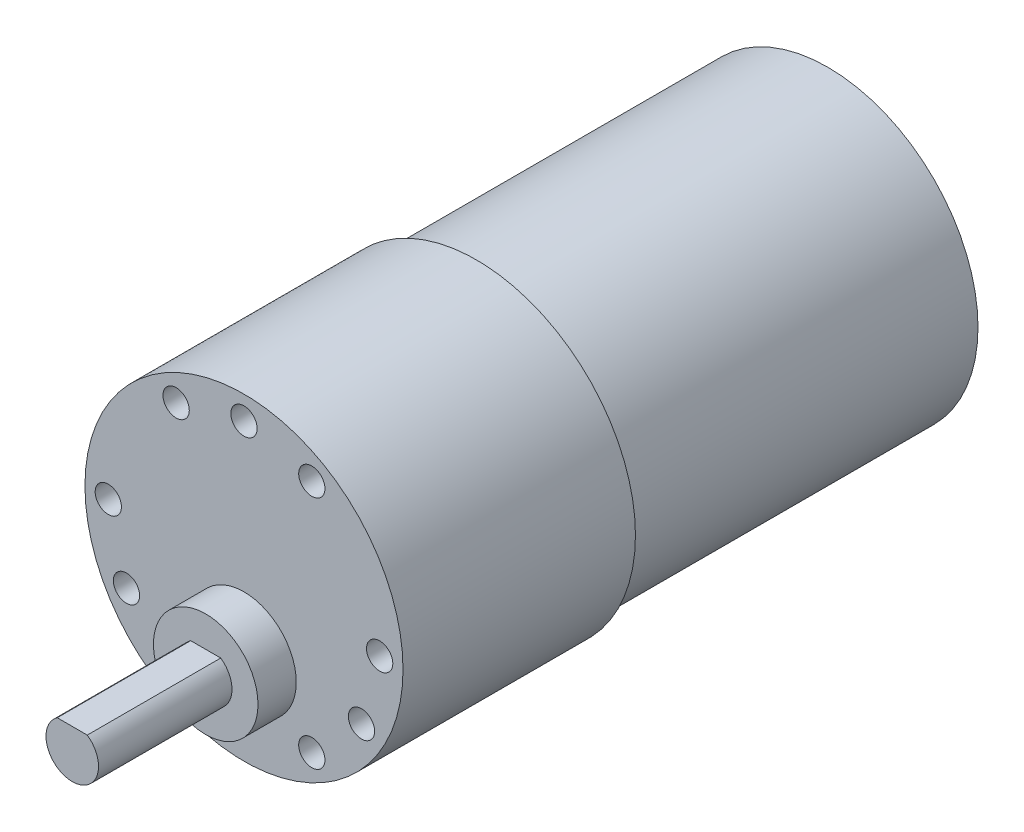
ISO-10303-21;
HEADER;
FILE_DESCRIPTION(('STEP AP214'),'2;1');
FILE_NAME('part.step','',(''),(''),'','','');
FILE_SCHEMA(('AUTOMOTIVE_DESIGN { 1 0 10303 214 1 1 1 1 }'));
ENDSEC;
DATA;
#1=APPLICATION_CONTEXT('core data for automotive mechanical design processes');
#2=APPLICATION_PROTOCOL_DEFINITION('international standard','automotive_design',2000,#1);
#3=PRODUCT_CONTEXT('',#1,'mechanical');
#4=PRODUCT('Part','Part','',(#3));
#5=PRODUCT_RELATED_PRODUCT_CATEGORY('part','',(#4));
#6=PRODUCT_DEFINITION_FORMATION('','',#4);
#7=PRODUCT_DEFINITION_CONTEXT('part definition',#1,'design');
#8=PRODUCT_DEFINITION('design','',#6,#7);
#9=PRODUCT_DEFINITION_SHAPE('','',#8);
#10=(LENGTH_UNIT() NAMED_UNIT(*) SI_UNIT(.MILLI.,.METRE.));
#11=(NAMED_UNIT(*) PLANE_ANGLE_UNIT() SI_UNIT($,.RADIAN.));
#12=(NAMED_UNIT(*) SI_UNIT($,.STERADIAN.) SOLID_ANGLE_UNIT());
#13=UNCERTAINTY_MEASURE_WITH_UNIT(LENGTH_MEASURE(1.E-05),#10,'distance_accuracy_value','');
#14=(GEOMETRIC_REPRESENTATION_CONTEXT(3) GLOBAL_UNCERTAINTY_ASSIGNED_CONTEXT((#13)) GLOBAL_UNIT_ASSIGNED_CONTEXT((#10,
#11,#12)) REPRESENTATION_CONTEXT('',''));
#15=CARTESIAN_POINT('',(0.,0.,0.));
#16=DIRECTION('',(0.,0.,1.));
#17=DIRECTION('',(1.,0.,0.));
#18=AXIS2_PLACEMENT_3D('',#15,#16,#17);
#19=CARTESIAN_POINT('',(0.,0.,-39.116));
#20=DIRECTION('',(0.,0.,-1.));
#21=DIRECTION('',(-1.,0.,0.));
#22=AXIS2_PLACEMENT_3D('',#19,#20,#21);
#23=PLANE('',#22);
#24=DIRECTION('',(0.642787609686543,-0.766044443118975,0.));
#25=VECTOR('',#24,1.);
#26=CARTESIAN_POINT('',(7.15248709016497,-8.91915603771026,-39.116));
#27=LINE('',#26,#25);
#28=CARTESIAN_POINT('',(5.51980656156115,-6.97340315218807,-39.116));
#29=VERTEX_POINT('',#28);
#30=CARTESIAN_POINT('',(7.15248709016497,-8.91915603771026,-39.116));
#31=VERTEX_POINT('',#30);
#32=EDGE_CURVE('E63',#29,#31,#27,.T.);
#33=ORIENTED_EDGE('',*,*,#32,.T.);
#34=DIRECTION('',(-0.766044443118975,-0.642787609686543,0.));
#35=VECTOR('',#34,1.);
#36=CARTESIAN_POINT('',(7.54163766726941,-8.5926199319895,-39.116));
#37=LINE('',#36,#35);
#38=CARTESIAN_POINT('',(7.54163766726941,-8.5926199319895,-39.116));
#39=VERTEX_POINT('',#38);
#40=EDGE_CURVE('E204',#39,#31,#37,.T.);
#41=ORIENTED_EDGE('',*,*,#40,.F.);
#42=DIRECTION('',(0.642787609686543,-0.766044443118975,0.));
#43=VECTOR('',#42,1.);
#44=CARTESIAN_POINT('',(7.54163766726941,-8.5926199319895,-39.116));
#45=LINE('',#44,#43);
#46=CARTESIAN_POINT('',(5.90895713866559,-6.6468670464673,-39.116));
#47=VERTEX_POINT('',#46);
#48=EDGE_CURVE('E179',#47,#39,#45,.T.);
#49=ORIENTED_EDGE('',*,*,#48,.F.);
#50=DIRECTION('',(-0.766044443118975,-0.642787609686543,0.));
#51=VECTOR('',#50,1.);
#52=CARTESIAN_POINT('',(5.90895713866559,-6.6468670464673,-39.116));
#53=LINE('',#52,#51);
#54=EDGE_CURVE('E189',#47,#29,#53,.T.);
#55=ORIENTED_EDGE('',*,*,#54,.T.);
#56=EDGE_LOOP('',(#33,#41,#49,#55));
#57=FACE_BOUND('',#56,.T.);
#58=CARTESIAN_POINT('',(0.,0.,-39.116));
#59=DIRECTION('',(0.,0.,-1.));
#60=DIRECTION('',(-1.,0.,0.));
#61=AXIS2_PLACEMENT_3D('',#58,#59,#60);
#62=CIRCLE('',#61,16.637);
#63=CARTESIAN_POINT('',(-16.637,0.,-39.116));
#64=VERTEX_POINT('',#63);
#65=EDGE_CURVE('E12',#64,#64,#62,.T.);
#66=ORIENTED_EDGE('',*,*,#65,.T.);
#67=EDGE_LOOP('',(#66));
#68=FACE_BOUND('',#67,.T.);
#69=DIRECTION('',(-0.258819045102518,-0.965925826289069,0.));
#70=VECTOR('',#69,1.);
#71=CARTESIAN_POINT('',(-2.87494665811901,-9.7480663576409,-39.116));
#72=LINE('',#71,#70);
#73=CARTESIAN_POINT('',(-2.87494665811901,-9.7480663576409,-39.116));
#74=VERTEX_POINT('',#73);
#75=CARTESIAN_POINT('',(-3.5323470326794,-12.2015179564151,-39.116));
#76=VERTEX_POINT('',#75);
#77=EDGE_CURVE('E55',#74,#76,#72,.T.);
#78=ORIENTED_EDGE('',*,*,#77,.T.);
#79=DIRECTION('',(-0.965925826289069,0.258819045102518,0.));
#80=VECTOR('',#79,1.);
#81=CARTESIAN_POINT('',(-3.04165671292456,-12.3329980313272,-39.116));
#82=LINE('',#81,#80);
#83=CARTESIAN_POINT('',(-3.04165671292456,-12.3329980313272,-39.116));
#84=VERTEX_POINT('',#83);
#85=EDGE_CURVE('E150',#84,#76,#82,.T.);
#86=ORIENTED_EDGE('',*,*,#85,.F.);
#87=DIRECTION('',(-0.258819045102518,-0.965925826289069,0.));
#88=VECTOR('',#87,1.);
#89=CARTESIAN_POINT('',(-2.38425633836416,-9.87954643255298,-39.116));
#90=LINE('',#89,#88);
#91=CARTESIAN_POINT('',(-2.38425633836416,-9.87954643255298,-39.116));
#92=VERTEX_POINT('',#91);
#93=EDGE_CURVE('E156',#92,#84,#90,.T.);
#94=ORIENTED_EDGE('',*,*,#93,.F.);
#95=DIRECTION('',(-0.965925826289069,0.258819045102518,0.));
#96=VECTOR('',#95,1.);
#97=CARTESIAN_POINT('',(-2.38425633836416,-9.87954643255298,-39.116));
#98=LINE('',#97,#96);
#99=EDGE_CURVE('E521',#92,#74,#98,.T.);
#100=ORIENTED_EDGE('',*,*,#99,.T.);
#101=EDGE_LOOP('',(#78,#86,#94,#100));
#102=FACE_BOUND('',#101,.T.);
#103=ADVANCED_FACE('F41',(#57,#68,#102),#23,.T.);
#104=CARTESIAN_POINT('',(0.,0.,-40.132));
#105=DIRECTION('',(0.,0.,-1.));
#106=DIRECTION('',(-1.,0.,0.));
#107=AXIS2_PLACEMENT_3D('',#104,#105,#106);
#108=PLANE('',#107);
#109=CARTESIAN_POINT('',(0.,0.,-40.132));
#110=DIRECTION('',(0.,0.,-1.));
#111=DIRECTION('',(-1.,0.,0.));
#112=AXIS2_PLACEMENT_3D('',#109,#110,#111);
#113=CIRCLE('',#112,16.637);
#114=CARTESIAN_POINT('',(-16.637,0.,-40.132));
#115=VERTEX_POINT('',#114);
#116=EDGE_CURVE('E48',#115,#115,#113,.T.);
#117=ORIENTED_EDGE('',*,*,#116,.F.);
#118=EDGE_LOOP('',(#117));
#119=FACE_BOUND('',#118,.T.);
#120=CARTESIAN_POINT('',(0.,0.,-40.132));
#121=DIRECTION('',(0.,0.,-1.));
#122=DIRECTION('',(-1.,0.,0.));
#123=AXIS2_PLACEMENT_3D('',#120,#121,#122);
#124=CIRCLE('',#123,17.145);
#125=CARTESIAN_POINT('',(-17.145,0.,-40.132));
#126=VERTEX_POINT('',#125);
#127=EDGE_CURVE('E207',#126,#126,#124,.T.);
#128=ORIENTED_EDGE('',*,*,#127,.T.);
#129=EDGE_LOOP('',(#128));
#130=FACE_BOUND('',#129,.T.);
#131=ADVANCED_FACE('F298',(#119,#130),#108,.T.);
#132=CARTESIAN_POINT('',(0.,0.,0.));
#133=DIRECTION('',(0.,0.,1.));
#134=DIRECTION('',(1.,0.,0.));
#135=AXIS2_PLACEMENT_3D('',#132,#133,#134);
#136=PLANE('',#135);
#137=CARTESIAN_POINT('',(0.,0.,0.));
#138=DIRECTION('',(0.,0.,1.));
#139=DIRECTION('',(1.,0.,0.));
#140=AXIS2_PLACEMENT_3D('',#137,#138,#139);
#141=CIRCLE('',#140,18.161);
#142=CARTESIAN_POINT('',(18.161,0.,0.));
#143=VERTEX_POINT('',#142);
#144=EDGE_CURVE('E212',#143,#143,#141,.T.);
#145=ORIENTED_EDGE('',*,*,#144,.F.);
#146=EDGE_LOOP('',(#145));
#147=FACE_BOUND('',#146,.T.);
#148=CARTESIAN_POINT('',(0.,0.,0.));
#149=DIRECTION('',(0.,0.,1.));
#150=DIRECTION('',(1.,0.,0.));
#151=AXIS2_PLACEMENT_3D('',#148,#149,#150);
#152=CIRCLE('',#151,17.145);
#153=CARTESIAN_POINT('',(17.145,0.,0.));
#154=VERTEX_POINT('',#153);
#155=EDGE_CURVE('E208',#154,#154,#152,.F.);
#156=ORIENTED_EDGE('',*,*,#155,.F.);
#157=EDGE_LOOP('',(#156));
#158=FACE_BOUND('',#157,.T.);
#159=ADVANCED_FACE('F301',(#147,#158),#136,.F.);
#160=CARTESIAN_POINT('',(0.,-7.366,30.9118));
#161=DIRECTION('',(0.,0.,1.));
#162=DIRECTION('',(1.,0.,0.));
#163=AXIS2_PLACEMENT_3D('',#160,#161,#162);
#164=PLANE('',#163);
#165=CARTESIAN_POINT('',(0.,-7.366,30.9118));
#166=DIRECTION('',(0.,0.,1.));
#167=DIRECTION('',(1.,0.,0.));
#168=AXIS2_PLACEMENT_3D('',#165,#166,#167);
#169=CIRCLE('',#168,5.969);
#170=CARTESIAN_POINT('',(5.969,-7.366,30.9118));
#171=VERTEX_POINT('',#170);
#172=EDGE_CURVE('E219',#171,#171,#169,.T.);
#173=ORIENTED_EDGE('',*,*,#172,.T.);
#174=EDGE_LOOP('',(#173));
#175=FACE_BOUND('',#174,.T.);
#176=DIRECTION('',(-1.,0.,0.));
#177=VECTOR('',#176,1.);
#178=CARTESIAN_POINT('',(-1.71565701700544,-4.905,30.9118));
#179=LINE('',#178,#177);
#180=CARTESIAN_POINT('',(1.71565701700544,-4.905,30.9118));
#181=VERTEX_POINT('',#180);
#182=CARTESIAN_POINT('',(-1.71565701700544,-4.905,30.9118));
#183=VERTEX_POINT('',#182);
#184=EDGE_CURVE('E229',#181,#183,#179,.T.);
#185=ORIENTED_EDGE('',*,*,#184,.F.);
#186=CARTESIAN_POINT('',(0.,-7.366,30.9118));
#187=DIRECTION('',(0.,0.,1.));
#188=DIRECTION('',(1.,0.,0.));
#189=AXIS2_PLACEMENT_3D('',#186,#187,#188);
#190=CIRCLE('',#189,3.);
#191=EDGE_CURVE('E222',#183,#181,#190,.T.);
#192=ORIENTED_EDGE('',*,*,#191,.F.);
#193=EDGE_LOOP('',(#185,#192));
#194=FACE_BOUND('',#193,.T.);
#195=ADVANCED_FACE('F313',(#175,#194),#164,.T.);
#196=CARTESIAN_POINT('',(0.,0.,26.543));
#197=DIRECTION('',(0.,0.,1.));
#198=DIRECTION('',(1.,0.,0.));
#199=AXIS2_PLACEMENT_3D('',#196,#197,#198);
#200=PLANE('',#199);
#201=CARTESIAN_POINT('',(-7.74699999999983,13.4181976062362,26.543));
#202=DIRECTION('',(0.,0.,1.));
#203=DIRECTION('',(1.,0.,0.));
#204=AXIS2_PLACEMENT_3D('',#201,#202,#203);
#205=CIRCLE('',#204,1.49999999999999);
#206=CARTESIAN_POINT('',(-6.24699999999984,13.4181976062362,26.543));
#207=VERTEX_POINT('',#206);
#208=EDGE_CURVE('E211',#207,#207,#205,.T.);
#209=ORIENTED_EDGE('',*,*,#208,.F.);
#210=EDGE_LOOP('',(#209));
#211=FACE_BOUND('',#210,.T.);
#212=CARTESIAN_POINT('',(-15.494,1.62291035592107E-13,26.543));
#213=DIRECTION('',(0.,0.,1.));
#214=DIRECTION('',(1.,0.,0.));
#215=AXIS2_PLACEMENT_3D('',#212,#213,#214);
#216=CIRCLE('',#215,1.49999999999999);
#217=CARTESIAN_POINT('',(-13.994,1.62291035592107E-13,26.543));
#218=VERTEX_POINT('',#217);
#219=EDGE_CURVE('E284',#218,#218,#216,.T.);
#220=ORIENTED_EDGE('',*,*,#219,.F.);
#221=EDGE_LOOP('',(#220));
#222=FACE_BOUND('',#221,.T.);
#223=CARTESIAN_POINT('',(-13.4181976062362,-7.74699999999987,26.543));
#224=DIRECTION('',(0.,0.,1.));
#225=DIRECTION('',(1.,0.,0.));
#226=AXIS2_PLACEMENT_3D('',#223,#224,#225);
#227=CIRCLE('',#226,1.49999999999999);
#228=CARTESIAN_POINT('',(-11.9181976062362,-7.74699999999987,26.543));
#229=VERTEX_POINT('',#228);
#230=EDGE_CURVE('E278',#229,#229,#227,.T.);
#231=ORIENTED_EDGE('',*,*,#230,.F.);
#232=EDGE_LOOP('',(#231));
#233=FACE_BOUND('',#232,.T.);
#234=CARTESIAN_POINT('',(-7.74700000000011,-13.418197606236,26.543));
#235=DIRECTION('',(0.,0.,1.));
#236=DIRECTION('',(1.,0.,0.));
#237=AXIS2_PLACEMENT_3D('',#234,#235,#236);
#238=CIRCLE('',#237,1.49999999999999);
#239=CARTESIAN_POINT('',(-6.24700000000012,-13.418197606236,26.543));
#240=VERTEX_POINT('',#239);
#241=EDGE_CURVE('E272',#240,#240,#238,.T.);
#242=ORIENTED_EDGE('',*,*,#241,.F.);
#243=EDGE_LOOP('',(#242));
#244=FACE_BOUND('',#243,.T.);
#245=CARTESIAN_POINT('',(7.74699999999992,-13.4181976062361,26.543));
#246=DIRECTION('',(0.,0.,1.));
#247=DIRECTION('',(1.,0.,0.));
#248=AXIS2_PLACEMENT_3D('',#245,#246,#247);
#249=CIRCLE('',#248,1.49999999999999);
#250=CARTESIAN_POINT('',(9.24699999999991,-13.4181976062361,26.543));
#251=VERTEX_POINT('',#250);
#252=EDGE_CURVE('E266',#251,#251,#249,.T.);
#253=ORIENTED_EDGE('',*,*,#252,.F.);
#254=EDGE_LOOP('',(#253));
#255=FACE_BOUND('',#254,.T.);
#256=CARTESIAN_POINT('',(13.4181976062361,-7.74700000000006,26.543));
#257=DIRECTION('',(0.,0.,1.));
#258=DIRECTION('',(1.,0.,0.));
#259=AXIS2_PLACEMENT_3D('',#256,#257,#258);
#260=CIRCLE('',#259,1.49999999999999);
#261=CARTESIAN_POINT('',(14.918197606236,-7.74700000000006,26.543));
#262=VERTEX_POINT('',#261);
#263=EDGE_CURVE('E260',#262,#262,#260,.T.);
#264=ORIENTED_EDGE('',*,*,#263,.F.);
#265=EDGE_LOOP('',(#264));
#266=FACE_BOUND('',#265,.T.);
#267=CARTESIAN_POINT('',(15.494,0.,26.543));
#268=DIRECTION('',(0.,0.,1.));
#269=DIRECTION('',(1.,0.,0.));
#270=AXIS2_PLACEMENT_3D('',#267,#268,#269);
#271=CIRCLE('',#270,1.49999999999999);
#272=CARTESIAN_POINT('',(16.994,0.,26.543));
#273=VERTEX_POINT('',#272);
#274=EDGE_CURVE('E254',#273,#273,#271,.T.);
#275=ORIENTED_EDGE('',*,*,#274,.F.);
#276=EDGE_LOOP('',(#275));
#277=FACE_BOUND('',#276,.T.);
#278=CARTESIAN_POINT('',(7.74700000000001,13.4181976062361,26.543));
#279=DIRECTION('',(0.,0.,1.));
#280=DIRECTION('',(1.,0.,0.));
#281=AXIS2_PLACEMENT_3D('',#278,#279,#280);
#282=CIRCLE('',#281,1.49999999999999);
#283=CARTESIAN_POINT('',(9.24700000000001,13.4181976062361,26.543));
#284=VERTEX_POINT('',#283);
#285=EDGE_CURVE('E248',#284,#284,#282,.T.);
#286=ORIENTED_EDGE('',*,*,#285,.F.);
#287=EDGE_LOOP('',(#286));
#288=FACE_BOUND('',#287,.T.);
#289=CARTESIAN_POINT('',(0.,15.494,26.543));
#290=DIRECTION('',(0.,0.,1.));
#291=DIRECTION('',(1.,0.,0.));
#292=AXIS2_PLACEMENT_3D('',#289,#290,#291);
#293=CIRCLE('',#292,1.49999999999999);
#294=CARTESIAN_POINT('',(1.49999999999999,15.494,26.543));
#295=VERTEX_POINT('',#294);
#296=EDGE_CURVE('E242',#295,#295,#293,.T.);
#297=ORIENTED_EDGE('',*,*,#296,.F.);
#298=EDGE_LOOP('',(#297));
#299=FACE_BOUND('',#298,.T.);
#300=CARTESIAN_POINT('',(0.,0.,26.543));
#301=DIRECTION('',(0.,0.,1.));
#302=DIRECTION('',(1.,0.,0.));
#303=AXIS2_PLACEMENT_3D('',#300,#301,#302);
#304=CIRCLE('',#303,18.161);
#305=CARTESIAN_POINT('',(18.161,0.,26.543));
#306=VERTEX_POINT('',#305);
#307=EDGE_CURVE('E216',#306,#306,#304,.T.);
#308=ORIENTED_EDGE('',*,*,#307,.T.);
#309=EDGE_LOOP('',(#308));
#310=FACE_BOUND('',#309,.T.);
#311=CARTESIAN_POINT('',(0.,-7.366,26.543));
#312=DIRECTION('',(0.,0.,1.));
#313=DIRECTION('',(1.,0.,0.));
#314=AXIS2_PLACEMENT_3D('',#311,#312,#313);
#315=CIRCLE('',#314,5.969);
#316=CARTESIAN_POINT('',(5.969,-7.366,26.543));
#317=VERTEX_POINT('',#316);
#318=EDGE_CURVE('E215',#317,#317,#315,.T.);
#319=ORIENTED_EDGE('',*,*,#318,.F.);
#320=EDGE_LOOP('',(#319));
#321=FACE_BOUND('',#320,.T.);
#322=ADVANCED_FACE('F319',(#211,#222,#233,#244,#255,#266,#277,#288,#299,#310,#321),#200,.T.);
#323=CARTESIAN_POINT('',(0.,0.,26.543));
#324=DIRECTION('',(0.,0.,-1.));
#325=DIRECTION('',(-1.,0.,0.));
#326=AXIS2_PLACEMENT_3D('',#323,#324,#325);
#327=CYLINDRICAL_SURFACE('',#326,18.161);
#328=ORIENTED_EDGE('',*,*,#307,.F.);
#329=EDGE_LOOP('',(#328));
#330=FACE_BOUND('',#329,.T.);
#331=ORIENTED_EDGE('',*,*,#144,.T.);
#332=EDGE_LOOP('',(#331));
#333=FACE_BOUND('',#332,.T.);
#334=ADVANCED_FACE('F427',(#330,#333),#327,.T.);
#335=CARTESIAN_POINT('',(0.,-7.366,30.9118));
#336=DIRECTION('',(0.,0.,-1.));
#337=DIRECTION('',(-1.,0.,0.));
#338=AXIS2_PLACEMENT_3D('',#335,#336,#337);
#339=CYLINDRICAL_SURFACE('',#338,5.969);
#340=ORIENTED_EDGE('',*,*,#172,.F.);
#341=EDGE_LOOP('',(#340));
#342=FACE_BOUND('',#341,.T.);
#343=ORIENTED_EDGE('',*,*,#318,.T.);
#344=EDGE_LOOP('',(#343));
#345=FACE_BOUND('',#344,.T.);
#346=ADVANCED_FACE('F423',(#342,#345),#339,.T.);
#347=CARTESIAN_POINT('',(0.,-7.366,46.1518));
#348=DIRECTION('',(0.,0.,-1.));
#349=DIRECTION('',(-1.,0.,0.));
#350=AXIS2_PLACEMENT_3D('',#347,#348,#349);
#351=CYLINDRICAL_SURFACE('',#350,3.);
#352=ORIENTED_EDGE('',*,*,#191,.T.);
#353=DIRECTION('',(0.,0.,-1.));
#354=VECTOR('',#353,1.);
#355=CARTESIAN_POINT('',(1.71565701700544,-4.905,46.1518));
#356=LINE('',#355,#354);
#357=CARTESIAN_POINT('',(1.71565701700544,-4.905,46.1518));
#358=VERTEX_POINT('',#357);
#359=EDGE_CURVE('E225',#358,#181,#356,.T.);
#360=ORIENTED_EDGE('',*,*,#359,.F.);
#361=CARTESIAN_POINT('',(0.,-7.366,46.1518));
#362=DIRECTION('',(0.,0.,1.));
#363=DIRECTION('',(1.,0.,0.));
#364=AXIS2_PLACEMENT_3D('',#361,#362,#363);
#365=CIRCLE('',#364,3.);
#366=CARTESIAN_POINT('',(-1.71565701700544,-4.905,46.1518));
#367=VERTEX_POINT('',#366);
#368=EDGE_CURVE('E228',#367,#358,#365,.T.);
#369=ORIENTED_EDGE('',*,*,#368,.F.);
#370=DIRECTION('',(0.,0.,-1.));
#371=VECTOR('',#370,1.);
#372=CARTESIAN_POINT('',(-1.71565701700544,-4.905,46.1518));
#373=LINE('',#372,#371);
#374=EDGE_CURVE('E230',#367,#183,#373,.T.);
#375=ORIENTED_EDGE('',*,*,#374,.T.);
#376=EDGE_LOOP('',(#352,#360,#369,#375));
#377=FACE_BOUND('',#376,.T.);
#378=ADVANCED_FACE('F420',(#377),#351,.T.);
#379=CARTESIAN_POINT('',(-1.71565701700544,-4.905,46.1518));
#380=DIRECTION('',(0.,-1.,0.));
#381=DIRECTION('',(0.,0.,-1.));
#382=AXIS2_PLACEMENT_3D('',#379,#380,#381);
#383=PLANE('',#382);
#384=ORIENTED_EDGE('',*,*,#184,.T.);
#385=ORIENTED_EDGE('',*,*,#374,.F.);
#386=DIRECTION('',(-1.,0.,0.));
#387=VECTOR('',#386,1.);
#388=CARTESIAN_POINT('',(-1.71565701700544,-4.905,46.1518));
#389=LINE('',#388,#387);
#390=EDGE_CURVE('E235',#358,#367,#389,.T.);
#391=ORIENTED_EDGE('',*,*,#390,.F.);
#392=ORIENTED_EDGE('',*,*,#359,.T.);
#393=EDGE_LOOP('',(#384,#385,#391,#392));
#394=FACE_BOUND('',#393,.T.);
#395=ADVANCED_FACE('F416',(#394),#383,.F.);
#396=CARTESIAN_POINT('',(0.,-7.366,46.1518));
#397=DIRECTION('',(0.,0.,1.));
#398=DIRECTION('',(1.,0.,0.));
#399=AXIS2_PLACEMENT_3D('',#396,#397,#398);
#400=PLANE('',#399);
#401=ORIENTED_EDGE('',*,*,#368,.T.);
#402=ORIENTED_EDGE('',*,*,#390,.T.);
#403=EDGE_LOOP('',(#401,#402));
#404=FACE_BOUND('',#403,.T.);
#405=ADVANCED_FACE('F412',(#404),#400,.T.);
#406=CARTESIAN_POINT('',(0.,15.494,16.383));
#407=DIRECTION('',(0.,0.,1.));
#408=DIRECTION('',(1.,0.,0.));
#409=AXIS2_PLACEMENT_3D('',#406,#407,#408);
#410=CONICAL_SURFACE('',#409,1.49999999999999,1.02974425867665);
#411=CARTESIAN_POINT('',(0.,15.494,15.4817090714587));
#412=VERTEX_POINT('',#411);
#413=VERTEX_LOOP('',#412);
#414=FACE_BOUND('',#413,.T.);
#415=CARTESIAN_POINT('',(0.,15.494,16.383));
#416=DIRECTION('',(0.,0.,1.));
#417=DIRECTION('',(1.,0.,0.));
#418=AXIS2_PLACEMENT_3D('',#415,#416,#417);
#419=CIRCLE('',#418,1.49999999999999);
#420=CARTESIAN_POINT('',(1.49999999999999,15.494,16.383));
#421=VERTEX_POINT('',#420);
#422=EDGE_CURVE('E237',#421,#421,#419,.T.);
#423=ORIENTED_EDGE('',*,*,#422,.T.);
#424=EDGE_LOOP('',(#423));
#425=FACE_BOUND('',#424,.T.);
#426=ADVANCED_FACE('F408',(#414,#425),#410,.F.);
#427=CARTESIAN_POINT('',(0.,15.494,26.543));
#428=DIRECTION('',(0.,0.,1.));
#429=DIRECTION('',(1.,0.,0.));
#430=AXIS2_PLACEMENT_3D('',#427,#428,#429);
#431=CYLINDRICAL_SURFACE('',#430,1.49999999999999);
#432=ORIENTED_EDGE('',*,*,#422,.F.);
#433=EDGE_LOOP('',(#432));
#434=FACE_BOUND('',#433,.T.);
#435=ORIENTED_EDGE('',*,*,#296,.T.);
#436=EDGE_LOOP('',(#435));
#437=FACE_BOUND('',#436,.T.);
#438=ADVANCED_FACE('F404',(#434,#437),#431,.F.);
#439=CARTESIAN_POINT('',(7.74700000000001,13.4181976062361,16.383));
#440=DIRECTION('',(0.,0.,1.));
#441=DIRECTION('',(1.,0.,0.));
#442=AXIS2_PLACEMENT_3D('',#439,#440,#441);
#443=CONICAL_SURFACE('',#442,1.49999999999999,1.02974425867665);
#444=CARTESIAN_POINT('',(7.74700000000001,13.4181976062361,15.4817090714587));
#445=VERTEX_POINT('',#444);
#446=VERTEX_LOOP('',#445);
#447=FACE_BOUND('',#446,.T.);
#448=CARTESIAN_POINT('',(7.74700000000001,13.4181976062361,16.383));
#449=DIRECTION('',(0.,0.,1.));
#450=DIRECTION('',(1.,0.,0.));
#451=AXIS2_PLACEMENT_3D('',#448,#449,#450);
#452=CIRCLE('',#451,1.49999999999999);
#453=CARTESIAN_POINT('',(9.247,13.4181976062361,16.383));
#454=VERTEX_POINT('',#453);
#455=EDGE_CURVE('E245',#454,#454,#452,.T.);
#456=ORIENTED_EDGE('',*,*,#455,.T.);
#457=EDGE_LOOP('',(#456));
#458=FACE_BOUND('',#457,.T.);
#459=ADVANCED_FACE('F400',(#447,#458),#443,.F.);
#460=CARTESIAN_POINT('',(7.74700000000001,13.4181976062361,26.543));
#461=DIRECTION('',(0.,0.,1.));
#462=DIRECTION('',(1.,0.,0.));
#463=AXIS2_PLACEMENT_3D('',#460,#461,#462);
#464=CYLINDRICAL_SURFACE('',#463,1.49999999999999);
#465=ORIENTED_EDGE('',*,*,#455,.F.);
#466=EDGE_LOOP('',(#465));
#467=FACE_BOUND('',#466,.T.);
#468=ORIENTED_EDGE('',*,*,#285,.T.);
#469=EDGE_LOOP('',(#468));
#470=FACE_BOUND('',#469,.T.);
#471=ADVANCED_FACE('F396',(#467,#470),#464,.F.);
#472=CARTESIAN_POINT('',(15.494,0.,16.383));
#473=DIRECTION('',(0.,0.,1.));
#474=DIRECTION('',(1.,0.,0.));
#475=AXIS2_PLACEMENT_3D('',#472,#473,#474);
#476=CONICAL_SURFACE('',#475,1.49999999999999,1.02974425867665);
#477=CARTESIAN_POINT('',(15.494,0.,15.4817090714587));
#478=VERTEX_POINT('',#477);
#479=VERTEX_LOOP('',#478);
#480=FACE_BOUND('',#479,.T.);
#481=CARTESIAN_POINT('',(15.494,0.,16.383));
#482=DIRECTION('',(0.,0.,1.));
#483=DIRECTION('',(1.,0.,0.));
#484=AXIS2_PLACEMENT_3D('',#481,#482,#483);
#485=CIRCLE('',#484,1.49999999999999);
#486=CARTESIAN_POINT('',(16.994,0.,16.383));
#487=VERTEX_POINT('',#486);
#488=EDGE_CURVE('E251',#487,#487,#485,.T.);
#489=ORIENTED_EDGE('',*,*,#488,.T.);
#490=EDGE_LOOP('',(#489));
#491=FACE_BOUND('',#490,.T.);
#492=ADVANCED_FACE('F392',(#480,#491),#476,.F.);
#493=CARTESIAN_POINT('',(15.494,0.,26.543));
#494=DIRECTION('',(0.,0.,1.));
#495=DIRECTION('',(1.,0.,0.));
#496=AXIS2_PLACEMENT_3D('',#493,#494,#495);
#497=CYLINDRICAL_SURFACE('',#496,1.49999999999999);
#498=ORIENTED_EDGE('',*,*,#488,.F.);
#499=EDGE_LOOP('',(#498));
#500=FACE_BOUND('',#499,.T.);
#501=ORIENTED_EDGE('',*,*,#274,.T.);
#502=EDGE_LOOP('',(#501));
#503=FACE_BOUND('',#502,.T.);
#504=ADVANCED_FACE('F388',(#500,#503),#497,.F.);
#505=CARTESIAN_POINT('',(13.4181976062361,-7.74700000000006,16.383));
#506=DIRECTION('',(0.,0.,1.));
#507=DIRECTION('',(1.,0.,0.));
#508=AXIS2_PLACEMENT_3D('',#505,#506,#507);
#509=CONICAL_SURFACE('',#508,1.49999999999999,1.02974425867665);
#510=CARTESIAN_POINT('',(13.4181976062361,-7.74700000000006,15.4817090714587));
#511=VERTEX_POINT('',#510);
#512=VERTEX_LOOP('',#511);
#513=FACE_BOUND('',#512,.T.);
#514=CARTESIAN_POINT('',(13.4181976062361,-7.74700000000006,16.383));
#515=DIRECTION('',(0.,0.,1.));
#516=DIRECTION('',(1.,0.,0.));
#517=AXIS2_PLACEMENT_3D('',#514,#515,#516);
#518=CIRCLE('',#517,1.49999999999999);
#519=CARTESIAN_POINT('',(14.918197606236,-7.74700000000006,16.383));
#520=VERTEX_POINT('',#519);
#521=EDGE_CURVE('E257',#520,#520,#518,.T.);
#522=ORIENTED_EDGE('',*,*,#521,.T.);
#523=EDGE_LOOP('',(#522));
#524=FACE_BOUND('',#523,.T.);
#525=ADVANCED_FACE('F384',(#513,#524),#509,.F.);
#526=CARTESIAN_POINT('',(13.4181976062361,-7.74700000000006,26.543));
#527=DIRECTION('',(0.,0.,1.));
#528=DIRECTION('',(1.,0.,0.));
#529=AXIS2_PLACEMENT_3D('',#526,#527,#528);
#530=CYLINDRICAL_SURFACE('',#529,1.49999999999999);
#531=ORIENTED_EDGE('',*,*,#521,.F.);
#532=EDGE_LOOP('',(#531));
#533=FACE_BOUND('',#532,.T.);
#534=ORIENTED_EDGE('',*,*,#263,.T.);
#535=EDGE_LOOP('',(#534));
#536=FACE_BOUND('',#535,.T.);
#537=ADVANCED_FACE('F380',(#533,#536),#530,.F.);
#538=CARTESIAN_POINT('',(7.74699999999992,-13.4181976062361,16.383));
#539=DIRECTION('',(0.,0.,1.));
#540=DIRECTION('',(1.,0.,0.));
#541=AXIS2_PLACEMENT_3D('',#538,#539,#540);
#542=CONICAL_SURFACE('',#541,1.49999999999999,1.02974425867665);
#543=CARTESIAN_POINT('',(7.74699999999992,-13.4181976062361,15.4817090714587));
#544=VERTEX_POINT('',#543);
#545=VERTEX_LOOP('',#544);
#546=FACE_BOUND('',#545,.T.);
#547=CARTESIAN_POINT('',(7.74699999999992,-13.4181976062361,16.383));
#548=DIRECTION('',(0.,0.,1.));
#549=DIRECTION('',(1.,0.,0.));
#550=AXIS2_PLACEMENT_3D('',#547,#548,#549);
#551=CIRCLE('',#550,1.49999999999999);
#552=CARTESIAN_POINT('',(9.24699999999991,-13.4181976062361,16.383));
#553=VERTEX_POINT('',#552);
#554=EDGE_CURVE('E263',#553,#553,#551,.T.);
#555=ORIENTED_EDGE('',*,*,#554,.T.);
#556=EDGE_LOOP('',(#555));
#557=FACE_BOUND('',#556,.T.);
#558=ADVANCED_FACE('F376',(#546,#557),#542,.F.);
#559=CARTESIAN_POINT('',(7.74699999999992,-13.4181976062361,26.543));
#560=DIRECTION('',(0.,0.,1.));
#561=DIRECTION('',(1.,0.,0.));
#562=AXIS2_PLACEMENT_3D('',#559,#560,#561);
#563=CYLINDRICAL_SURFACE('',#562,1.49999999999999);
#564=ORIENTED_EDGE('',*,*,#554,.F.);
#565=EDGE_LOOP('',(#564));
#566=FACE_BOUND('',#565,.T.);
#567=ORIENTED_EDGE('',*,*,#252,.T.);
#568=EDGE_LOOP('',(#567));
#569=FACE_BOUND('',#568,.T.);
#570=ADVANCED_FACE('F372',(#566,#569),#563,.F.);
#571=CARTESIAN_POINT('',(-7.74700000000011,-13.418197606236,16.383));
#572=DIRECTION('',(0.,0.,1.));
#573=DIRECTION('',(1.,0.,0.));
#574=AXIS2_PLACEMENT_3D('',#571,#572,#573);
#575=CONICAL_SURFACE('',#574,1.49999999999999,1.02974425867665);
#576=CARTESIAN_POINT('',(-7.74700000000011,-13.418197606236,15.4817090714587));
#577=VERTEX_POINT('',#576);
#578=VERTEX_LOOP('',#577);
#579=FACE_BOUND('',#578,.T.);
#580=CARTESIAN_POINT('',(-7.74700000000011,-13.418197606236,16.383));
#581=DIRECTION('',(0.,0.,1.));
#582=DIRECTION('',(1.,0.,0.));
#583=AXIS2_PLACEMENT_3D('',#580,#581,#582);
#584=CIRCLE('',#583,1.49999999999999);
#585=CARTESIAN_POINT('',(-6.24700000000012,-13.418197606236,16.383));
#586=VERTEX_POINT('',#585);
#587=EDGE_CURVE('E269',#586,#586,#584,.T.);
#588=ORIENTED_EDGE('',*,*,#587,.T.);
#589=EDGE_LOOP('',(#588));
#590=FACE_BOUND('',#589,.T.);
#591=ADVANCED_FACE('F368',(#579,#590),#575,.F.);
#592=CARTESIAN_POINT('',(-7.74700000000011,-13.418197606236,26.543));
#593=DIRECTION('',(0.,0.,1.));
#594=DIRECTION('',(1.,0.,0.));
#595=AXIS2_PLACEMENT_3D('',#592,#593,#594);
#596=CYLINDRICAL_SURFACE('',#595,1.49999999999999);
#597=ORIENTED_EDGE('',*,*,#587,.F.);
#598=EDGE_LOOP('',(#597));
#599=FACE_BOUND('',#598,.T.);
#600=ORIENTED_EDGE('',*,*,#241,.T.);
#601=EDGE_LOOP('',(#600));
#602=FACE_BOUND('',#601,.T.);
#603=ADVANCED_FACE('F364',(#599,#602),#596,.F.);
#604=CARTESIAN_POINT('',(-13.4181976062362,-7.74699999999987,16.383));
#605=DIRECTION('',(0.,0.,1.));
#606=DIRECTION('',(1.,0.,0.));
#607=AXIS2_PLACEMENT_3D('',#604,#605,#606);
#608=CONICAL_SURFACE('',#607,1.49999999999999,1.02974425867665);
#609=CARTESIAN_POINT('',(-13.4181976062362,-7.74699999999987,15.4817090714587));
#610=VERTEX_POINT('',#609);
#611=VERTEX_LOOP('',#610);
#612=FACE_BOUND('',#611,.T.);
#613=CARTESIAN_POINT('',(-13.4181976062362,-7.74699999999987,16.383));
#614=DIRECTION('',(0.,0.,1.));
#615=DIRECTION('',(1.,0.,0.));
#616=AXIS2_PLACEMENT_3D('',#613,#614,#615);
#617=CIRCLE('',#616,1.49999999999999);
#618=CARTESIAN_POINT('',(-11.9181976062362,-7.74699999999987,16.383));
#619=VERTEX_POINT('',#618);
#620=EDGE_CURVE('E275',#619,#619,#617,.T.);
#621=ORIENTED_EDGE('',*,*,#620,.T.);
#622=EDGE_LOOP('',(#621));
#623=FACE_BOUND('',#622,.T.);
#624=ADVANCED_FACE('F360',(#612,#623),#608,.F.);
#625=CARTESIAN_POINT('',(-13.4181976062362,-7.74699999999987,26.543));
#626=DIRECTION('',(0.,0.,1.));
#627=DIRECTION('',(1.,0.,0.));
#628=AXIS2_PLACEMENT_3D('',#625,#626,#627);
#629=CYLINDRICAL_SURFACE('',#628,1.49999999999999);
#630=ORIENTED_EDGE('',*,*,#620,.F.);
#631=EDGE_LOOP('',(#630));
#632=FACE_BOUND('',#631,.T.);
#633=ORIENTED_EDGE('',*,*,#230,.T.);
#634=EDGE_LOOP('',(#633));
#635=FACE_BOUND('',#634,.T.);
#636=ADVANCED_FACE('F356',(#632,#635),#629,.F.);
#637=CARTESIAN_POINT('',(-15.494,1.62291035592107E-13,16.383));
#638=DIRECTION('',(0.,0.,1.));
#639=DIRECTION('',(1.,0.,0.));
#640=AXIS2_PLACEMENT_3D('',#637,#638,#639);
#641=CONICAL_SURFACE('',#640,1.49999999999999,1.02974425867665);
#642=CARTESIAN_POINT('',(-15.494,1.62291035592107E-13,15.4817090714587));
#643=VERTEX_POINT('',#642);
#644=VERTEX_LOOP('',#643);
#645=FACE_BOUND('',#644,.T.);
#646=CARTESIAN_POINT('',(-15.494,1.62291035592107E-13,16.383));
#647=DIRECTION('',(0.,0.,1.));
#648=DIRECTION('',(1.,0.,0.));
#649=AXIS2_PLACEMENT_3D('',#646,#647,#648);
#650=CIRCLE('',#649,1.49999999999999);
#651=CARTESIAN_POINT('',(-13.994,1.62291035592107E-13,16.383));
#652=VERTEX_POINT('',#651);
#653=EDGE_CURVE('E281',#652,#652,#650,.T.);
#654=ORIENTED_EDGE('',*,*,#653,.T.);
#655=EDGE_LOOP('',(#654));
#656=FACE_BOUND('',#655,.T.);
#657=ADVANCED_FACE('F352',(#645,#656),#641,.F.);
#658=CARTESIAN_POINT('',(-15.494,1.62291035592107E-13,26.543));
#659=DIRECTION('',(0.,0.,1.));
#660=DIRECTION('',(1.,0.,0.));
#661=AXIS2_PLACEMENT_3D('',#658,#659,#660);
#662=CYLINDRICAL_SURFACE('',#661,1.49999999999999);
#663=ORIENTED_EDGE('',*,*,#653,.F.);
#664=EDGE_LOOP('',(#663));
#665=FACE_BOUND('',#664,.T.);
#666=ORIENTED_EDGE('',*,*,#219,.T.);
#667=EDGE_LOOP('',(#666));
#668=FACE_BOUND('',#667,.T.);
#669=ADVANCED_FACE('F348',(#665,#668),#662,.F.);
#670=CARTESIAN_POINT('',(-7.74699999999983,13.4181976062362,16.383));
#671=DIRECTION('',(0.,0.,1.));
#672=DIRECTION('',(1.,0.,0.));
#673=AXIS2_PLACEMENT_3D('',#670,#671,#672);
#674=CONICAL_SURFACE('',#673,1.49999999999999,1.02974425867665);
#675=CARTESIAN_POINT('',(-7.74699999999983,13.4181976062362,15.4817090714587));
#676=VERTEX_POINT('',#675);
#677=VERTEX_LOOP('',#676);
#678=FACE_BOUND('',#677,.T.);
#679=CARTESIAN_POINT('',(-7.74699999999983,13.4181976062362,16.383));
#680=DIRECTION('',(0.,0.,1.));
#681=DIRECTION('',(1.,0.,0.));
#682=AXIS2_PLACEMENT_3D('',#679,#680,#681);
#683=CIRCLE('',#682,1.49999999999999);
#684=CARTESIAN_POINT('',(-6.24699999999984,13.4181976062362,16.383));
#685=VERTEX_POINT('',#684);
#686=EDGE_CURVE('E287',#685,#685,#683,.T.);
#687=ORIENTED_EDGE('',*,*,#686,.T.);
#688=EDGE_LOOP('',(#687));
#689=FACE_BOUND('',#688,.T.);
#690=ADVANCED_FACE('F344',(#678,#689),#674,.F.);
#691=CARTESIAN_POINT('',(-7.74699999999983,13.4181976062362,26.543));
#692=DIRECTION('',(0.,0.,1.));
#693=DIRECTION('',(1.,0.,0.));
#694=AXIS2_PLACEMENT_3D('',#691,#692,#693);
#695=CYLINDRICAL_SURFACE('',#694,1.49999999999999);
#696=ORIENTED_EDGE('',*,*,#686,.F.);
#697=EDGE_LOOP('',(#696));
#698=FACE_BOUND('',#697,.T.);
#699=ORIENTED_EDGE('',*,*,#208,.T.);
#700=EDGE_LOOP('',(#699));
#701=FACE_BOUND('',#700,.T.);
#702=ADVANCED_FACE('F308',(#698,#701),#695,.F.);
#703=CARTESIAN_POINT('',(0.,0.,-40.132));
#704=DIRECTION('',(0.,0.,1.));
#705=DIRECTION('',(1.,0.,0.));
#706=AXIS2_PLACEMENT_3D('',#703,#704,#705);
#707=CYLINDRICAL_SURFACE('',#706,17.145);
#708=ORIENTED_EDGE('',*,*,#127,.F.);
#709=EDGE_LOOP('',(#708));
#710=FACE_BOUND('',#709,.T.);
#711=ORIENTED_EDGE('',*,*,#155,.T.);
#712=EDGE_LOOP('',(#711));
#713=FACE_BOUND('',#712,.T.);
#714=ADVANCED_FACE('F305',(#710,#713),#707,.T.);
#715=CARTESIAN_POINT('',(0.,0.,-39.116));
#716=DIRECTION('',(0.,0.,-1.));
#717=DIRECTION('',(-1.,0.,0.));
#718=AXIS2_PLACEMENT_3D('',#715,#716,#717);
#719=CYLINDRICAL_SURFACE('',#718,16.637);
#720=ORIENTED_EDGE('',*,*,#65,.F.);
#721=EDGE_LOOP('',(#720));
#722=FACE_BOUND('',#721,.T.);
#723=ORIENTED_EDGE('',*,*,#116,.T.);
#724=EDGE_LOOP('',(#723));
#725=FACE_BOUND('',#724,.T.);
#726=ADVANCED_FACE('F296',(#722,#725),#719,.F.);
#727=CARTESIAN_POINT('',(0.19457528855222,0.163268052860382,0.));
#728=DIRECTION('',(-0.766044443118975,-0.642787609686543,0.));
#729=DIRECTION('',(0.642787609686543,-0.766044443118975,0.));
#730=AXIS2_PLACEMENT_3D('',#727,#728,#729);
#731=PLANE('',#730);
#732=ORIENTED_EDGE('',*,*,#48,.T.);
#733=DIRECTION('',(0.,0.,-1.));
#734=VECTOR('',#733,1.);
#735=CARTESIAN_POINT('',(7.54163766726941,-8.5926199319895,-44.196));
#736=LINE('',#735,#734);
#737=CARTESIAN_POINT('',(7.54163766726941,-8.5926199319895,-44.196));
#738=VERTEX_POINT('',#737);
#739=EDGE_CURVE('E182',#39,#738,#736,.T.);
#740=ORIENTED_EDGE('',*,*,#739,.T.);
#741=DIRECTION('',(-0.642787609686543,0.766044443118975,0.));
#742=VECTOR('',#741,1.);
#743=CARTESIAN_POINT('',(5.90895713866559,-6.6468670464673,-44.196));
#744=LINE('',#743,#742);
#745=CARTESIAN_POINT('',(5.90895713866559,-6.6468670464673,-44.196));
#746=VERTEX_POINT('',#745);
#747=EDGE_CURVE('E185',#738,#746,#744,.T.);
#748=ORIENTED_EDGE('',*,*,#747,.T.);
#749=DIRECTION('',(0.,0.,1.));
#750=VECTOR('',#749,1.);
#751=CARTESIAN_POINT('',(5.90895713866559,-6.6468670464673,-39.116));
#752=LINE('',#751,#750);
#753=EDGE_CURVE('E187',#746,#47,#752,.T.);
#754=ORIENTED_EDGE('',*,*,#753,.T.);
#755=EDGE_LOOP('',(#732,#740,#748,#754));
#756=FACE_BOUND('',#755,.T.);
#757=CARTESIAN_POINT('',(6.7252974029675,-7.6197434892284,-42.926));
#758=DIRECTION('',(0.766044443118975,0.642787609686543,0.));
#759=DIRECTION('',(-0.642787609686543,0.766044443118975,0.));
#760=AXIS2_PLACEMENT_3D('',#757,#758,#759);
#761=CIRCLE('',#760,0.4445);
#762=CARTESIAN_POINT('',(6.43957831046183,-7.27923673426202,-42.926));
#763=VERTEX_POINT('',#762);
#764=EDGE_CURVE('E171',#763,#763,#761,.T.);
#765=ORIENTED_EDGE('',*,*,#764,.F.);
#766=EDGE_LOOP('',(#765));
#767=FACE_BOUND('',#766,.T.);
#768=ADVANCED_FACE('F334',(#756,#767),#731,.F.);
#769=CARTESIAN_POINT('',(-0.19457528855222,-0.163268052860382,0.));
#770=DIRECTION('',(-0.766044443118975,-0.642787609686543,0.));
#771=DIRECTION('',(0.642787609686543,-0.766044443118975,0.));
#772=AXIS2_PLACEMENT_3D('',#769,#770,#771);
#773=PLANE('',#772);
#774=ORIENTED_EDGE('',*,*,#32,.F.);
#775=DIRECTION('',(0.,0.,1.));
#776=VECTOR('',#775,1.);
#777=CARTESIAN_POINT('',(5.51980656156115,-6.97340315218807,-39.116));
#778=LINE('',#777,#776);
#779=CARTESIAN_POINT('',(5.51980656156115,-6.97340315218807,-44.196));
#780=VERTEX_POINT('',#779);
#781=EDGE_CURVE('E183',#780,#29,#778,.T.);
#782=ORIENTED_EDGE('',*,*,#781,.F.);
#783=DIRECTION('',(-0.642787609686543,0.766044443118975,0.));
#784=VECTOR('',#783,1.);
#785=CARTESIAN_POINT('',(5.51980656156115,-6.97340315218807,-44.196));
#786=LINE('',#785,#784);
#787=CARTESIAN_POINT('',(7.15248709016497,-8.91915603771026,-44.196));
#788=VERTEX_POINT('',#787);
#789=EDGE_CURVE('E193',#788,#780,#786,.T.);
#790=ORIENTED_EDGE('',*,*,#789,.F.);
#791=DIRECTION('',(0.,0.,-1.));
#792=VECTOR('',#791,1.);
#793=CARTESIAN_POINT('',(7.15248709016497,-8.91915603771026,-44.196));
#794=LINE('',#793,#792);
#795=EDGE_CURVE('E191',#31,#788,#794,.T.);
#796=ORIENTED_EDGE('',*,*,#795,.F.);
#797=EDGE_LOOP('',(#774,#782,#790,#796));
#798=FACE_BOUND('',#797,.T.);
#799=CARTESIAN_POINT('',(6.33614682586306,-7.94627959494917,-42.926));
#800=DIRECTION('',(0.766044443118975,0.642787609686543,0.));
#801=DIRECTION('',(-0.642787609686543,0.766044443118975,0.));
#802=AXIS2_PLACEMENT_3D('',#799,#800,#801);
#803=CIRCLE('',#802,0.4445);
#804=CARTESIAN_POINT('',(6.0504277333574,-7.60577283998278,-42.926));
#805=VERTEX_POINT('',#804);
#806=EDGE_CURVE('E168',#805,#805,#803,.T.);
#807=ORIENTED_EDGE('',*,*,#806,.T.);
#808=EDGE_LOOP('',(#807));
#809=FACE_BOUND('',#808,.T.);
#810=ADVANCED_FACE('F338',(#798,#809),#773,.T.);
#811=CARTESIAN_POINT('',(7.54163766726941,-8.5926199319895,-44.196));
#812=DIRECTION('',(-0.642787609686543,0.766044443118975,0.));
#813=DIRECTION('',(-0.766044443118975,-0.642787609686543,0.));
#814=AXIS2_PLACEMENT_3D('',#811,#812,#813);
#815=PLANE('',#814);
#816=ORIENTED_EDGE('',*,*,#795,.T.);
#817=DIRECTION('',(-0.766044443118975,-0.642787609686543,0.));
#818=VECTOR('',#817,1.);
#819=CARTESIAN_POINT('',(7.54163766726941,-8.5926199319895,-44.196));
#820=LINE('',#819,#818);
#821=EDGE_CURVE('E201',#738,#788,#820,.T.);
#822=ORIENTED_EDGE('',*,*,#821,.F.);
#823=ORIENTED_EDGE('',*,*,#739,.F.);
#824=ORIENTED_EDGE('',*,*,#40,.T.);
#825=EDGE_LOOP('',(#816,#822,#823,#824));
#826=FACE_BOUND('',#825,.T.);
#827=ADVANCED_FACE('F470',(#826),#815,.F.);
#828=CARTESIAN_POINT('',(5.90895713866559,-6.6468670464673,-44.196));
#829=DIRECTION('',(0.,0.,1.));
#830=DIRECTION('',(1.,0.,0.));
#831=AXIS2_PLACEMENT_3D('',#828,#829,#830);
#832=PLANE('',#831);
#833=ORIENTED_EDGE('',*,*,#789,.T.);
#834=DIRECTION('',(-0.766044443118975,-0.642787609686543,0.));
#835=VECTOR('',#834,1.);
#836=CARTESIAN_POINT('',(5.90895713866559,-6.6468670464673,-44.196));
#837=LINE('',#836,#835);
#838=EDGE_CURVE('E198',#746,#780,#837,.T.);
#839=ORIENTED_EDGE('',*,*,#838,.F.);
#840=ORIENTED_EDGE('',*,*,#747,.F.);
#841=ORIENTED_EDGE('',*,*,#821,.T.);
#842=EDGE_LOOP('',(#833,#839,#840,#841));
#843=FACE_BOUND('',#842,.T.);
#844=ADVANCED_FACE('F473',(#843),#832,.F.);
#845=CARTESIAN_POINT('',(5.90895713866559,-6.6468670464673,-39.116));
#846=DIRECTION('',(0.642787609686543,-0.766044443118975,0.));
#847=DIRECTION('',(0.766044443118975,0.642787609686543,0.));
#848=AXIS2_PLACEMENT_3D('',#845,#846,#847);
#849=PLANE('',#848);
#850=ORIENTED_EDGE('',*,*,#781,.T.);
#851=ORIENTED_EDGE('',*,*,#54,.F.);
#852=ORIENTED_EDGE('',*,*,#753,.F.);
#853=ORIENTED_EDGE('',*,*,#838,.T.);
#854=EDGE_LOOP('',(#850,#851,#852,#853));
#855=FACE_BOUND('',#854,.T.);
#856=ADVANCED_FACE('F477',(#855),#849,.F.);
#857=CARTESIAN_POINT('',(6.7252974029675,-7.6197434892284,-42.926));
#858=DIRECTION('',(-0.766044443118975,-0.642787609686543,0.));
#859=DIRECTION('',(0.642787609686543,-0.766044443118975,0.));
#860=AXIS2_PLACEMENT_3D('',#857,#858,#859);
#861=CYLINDRICAL_SURFACE('',#860,0.4445);
#862=ORIENTED_EDGE('',*,*,#764,.T.);
#863=EDGE_LOOP('',(#862));
#864=FACE_BOUND('',#863,.T.);
#865=ORIENTED_EDGE('',*,*,#806,.F.);
#866=EDGE_LOOP('',(#865));
#867=FACE_BOUND('',#866,.T.);
#868=ADVANCED_FACE('F481',(#864,#867),#861,.F.);
#869=CARTESIAN_POINT('',(0.245345159877424,-0.0657400374560397,0.));
#870=DIRECTION('',(0.965925826289069,-0.258819045102518,0.));
#871=DIRECTION('',(0.258819045102518,0.965925826289069,0.));
#872=AXIS2_PLACEMENT_3D('',#869,#870,#871);
#873=PLANE('',#872);
#874=ORIENTED_EDGE('',*,*,#93,.T.);
#875=DIRECTION('',(0.,0.,-1.));
#876=VECTOR('',#875,1.);
#877=CARTESIAN_POINT('',(-3.04165671292456,-12.3329980313272,-39.116));
#878=LINE('',#877,#876);
#879=CARTESIAN_POINT('',(-3.04165671292456,-12.3329980313272,-44.196));
#880=VERTEX_POINT('',#879);
#881=EDGE_CURVE('E146',#84,#880,#878,.T.);
#882=ORIENTED_EDGE('',*,*,#881,.T.);
#883=DIRECTION('',(0.258819045102518,0.965925826289069,0.));
#884=VECTOR('',#883,1.);
#885=CARTESIAN_POINT('',(-3.04165671292456,-12.3329980313272,-44.196));
#886=LINE('',#885,#884);
#887=CARTESIAN_POINT('',(-2.38425633836416,-9.87954643255298,-44.196));
#888=VERTEX_POINT('',#887);
#889=EDGE_CURVE('E155',#880,#888,#886,.T.);
#890=ORIENTED_EDGE('',*,*,#889,.T.);
#891=DIRECTION('',(0.,0.,1.));
#892=VECTOR('',#891,1.);
#893=CARTESIAN_POINT('',(-2.38425633836416,-9.87954643255298,-44.196));
#894=LINE('',#893,#892);
#895=EDGE_CURVE('E162',#888,#92,#894,.T.);
#896=ORIENTED_EDGE('',*,*,#895,.T.);
#897=EDGE_LOOP('',(#874,#882,#890,#896));
#898=FACE_BOUND('',#897,.T.);
#899=CARTESIAN_POINT('',(-2.71295652564436,-11.1062722319401,-42.926));
#900=DIRECTION('',(0.965925826289069,-0.258819045102518,0.));
#901=DIRECTION('',(0.258819045102518,0.965925826289069,0.));
#902=AXIS2_PLACEMENT_3D('',#899,#900,#901);
#903=CIRCLE('',#902,0.678606607184046);
#904=CARTESIAN_POINT('',(-2.53732021157272,-10.4507885841706,-42.926));
#905=VERTEX_POINT('',#904);
#906=EDGE_CURVE('E511',#905,#905,#903,.T.);
#907=ORIENTED_EDGE('',*,*,#906,.F.);
#908=EDGE_LOOP('',(#907));
#909=FACE_BOUND('',#908,.T.);
#910=ADVANCED_FACE('F159',(#898,#909),#873,.T.);
#911=CARTESIAN_POINT('',(-0.245345159877423,0.0657400374560395,0.));
#912=DIRECTION('',(0.965925826289069,-0.258819045102518,0.));
#913=DIRECTION('',(0.258819045102518,0.965925826289069,0.));
#914=AXIS2_PLACEMENT_3D('',#911,#912,#913);
#915=PLANE('',#914);
#916=ORIENTED_EDGE('',*,*,#77,.F.);
#917=DIRECTION('',(0.,0.,1.));
#918=VECTOR('',#917,1.);
#919=CARTESIAN_POINT('',(-2.87494665811901,-9.7480663576409,-44.196));
#920=LINE('',#919,#918);
#921=CARTESIAN_POINT('',(-2.87494665811901,-9.7480663576409,-44.196));
#922=VERTEX_POINT('',#921);
#923=EDGE_CURVE('E166',#922,#74,#920,.T.);
#924=ORIENTED_EDGE('',*,*,#923,.F.);
#925=DIRECTION('',(0.258819045102518,0.965925826289069,0.));
#926=VECTOR('',#925,1.);
#927=CARTESIAN_POINT('',(-3.5323470326794,-12.2015179564151,-44.196));
#928=LINE('',#927,#926);
#929=CARTESIAN_POINT('',(-3.5323470326794,-12.2015179564151,-44.196));
#930=VERTEX_POINT('',#929);
#931=EDGE_CURVE('E525',#930,#922,#928,.T.);
#932=ORIENTED_EDGE('',*,*,#931,.F.);
#933=DIRECTION('',(0.,0.,-1.));
#934=VECTOR('',#933,1.);
#935=CARTESIAN_POINT('',(-3.5323470326794,-12.2015179564151,-39.116));
#936=LINE('',#935,#934);
#937=EDGE_CURVE('E523',#76,#930,#936,.T.);
#938=ORIENTED_EDGE('',*,*,#937,.F.);
#939=EDGE_LOOP('',(#916,#924,#932,#938));
#940=FACE_BOUND('',#939,.T.);
#941=CARTESIAN_POINT('',(-3.2036468453992,-10.974792157028,-42.926));
#942=DIRECTION('',(0.965925826289069,-0.258819045102518,0.));
#943=DIRECTION('',(0.258819045102518,0.965925826289069,0.));
#944=AXIS2_PLACEMENT_3D('',#941,#942,#943);
#945=CIRCLE('',#944,0.678606607184046);
#946=CARTESIAN_POINT('',(-3.02801053132757,-10.3193085092585,-42.926));
#947=VERTEX_POINT('',#946);
#948=EDGE_CURVE('E514',#947,#947,#945,.T.);
#949=ORIENTED_EDGE('',*,*,#948,.T.);
#950=EDGE_LOOP('',(#949));
#951=FACE_BOUND('',#950,.T.);
#952=ADVANCED_FACE('F491',(#940,#951),#915,.F.);
#953=CARTESIAN_POINT('',(-3.04165671292456,-12.3329980313272,-39.116));
#954=DIRECTION('',(0.258819045102518,0.965925826289069,0.));
#955=DIRECTION('',(-0.965925826289069,0.258819045102518,0.));
#956=AXIS2_PLACEMENT_3D('',#953,#954,#955);
#957=PLANE('',#956);
#958=ORIENTED_EDGE('',*,*,#937,.T.);
#959=DIRECTION('',(-0.965925826289069,0.258819045102518,0.));
#960=VECTOR('',#959,1.);
#961=CARTESIAN_POINT('',(-3.04165671292456,-12.3329980313272,-44.196));
#962=LINE('',#961,#960);
#963=EDGE_CURVE('E152',#880,#930,#962,.T.);
#964=ORIENTED_EDGE('',*,*,#963,.F.);
#965=ORIENTED_EDGE('',*,*,#881,.F.);
#966=ORIENTED_EDGE('',*,*,#85,.T.);
#967=EDGE_LOOP('',(#958,#964,#965,#966));
#968=FACE_BOUND('',#967,.T.);
#969=ADVANCED_FACE('F148',(#968),#957,.F.);
#970=CARTESIAN_POINT('',(-3.04165671292456,-12.3329980313272,-44.196));
#971=DIRECTION('',(0.,0.,1.));
#972=DIRECTION('',(1.,0.,0.));
#973=AXIS2_PLACEMENT_3D('',#970,#971,#972);
#974=PLANE('',#973);
#975=ORIENTED_EDGE('',*,*,#931,.T.);
#976=DIRECTION('',(-0.965925826289069,0.258819045102518,0.));
#977=VECTOR('',#976,1.);
#978=CARTESIAN_POINT('',(-2.38425633836416,-9.87954643255298,-44.196));
#979=LINE('',#978,#977);
#980=EDGE_CURVE('E173',#888,#922,#979,.T.);
#981=ORIENTED_EDGE('',*,*,#980,.F.);
#982=ORIENTED_EDGE('',*,*,#889,.F.);
#983=ORIENTED_EDGE('',*,*,#963,.T.);
#984=EDGE_LOOP('',(#975,#981,#982,#983));
#985=FACE_BOUND('',#984,.T.);
#986=ADVANCED_FACE('F490',(#985),#974,.F.);
#987=CARTESIAN_POINT('',(-2.38425633836416,-9.87954643255298,-44.196));
#988=DIRECTION('',(-0.258819045102518,-0.965925826289069,0.));
#989=DIRECTION('',(0.965925826289069,-0.258819045102518,0.));
#990=AXIS2_PLACEMENT_3D('',#987,#988,#989);
#991=PLANE('',#990);
#992=ORIENTED_EDGE('',*,*,#923,.T.);
#993=ORIENTED_EDGE('',*,*,#99,.F.);
#994=ORIENTED_EDGE('',*,*,#895,.F.);
#995=ORIENTED_EDGE('',*,*,#980,.T.);
#996=EDGE_LOOP('',(#992,#993,#994,#995));
#997=FACE_BOUND('',#996,.T.);
#998=ADVANCED_FACE('F494',(#997),#991,.F.);
#999=CARTESIAN_POINT('',(-2.71295652564436,-11.1062722319401,-42.926));
#1000=DIRECTION('',(-0.965925826289069,0.258819045102518,0.));
#1001=DIRECTION('',(-0.258819045102518,-0.965925826289069,0.));
#1002=AXIS2_PLACEMENT_3D('',#999,#1000,#1001);
#1003=CYLINDRICAL_SURFACE('',#1002,0.678606607184046);
#1004=ORIENTED_EDGE('',*,*,#906,.T.);
#1005=EDGE_LOOP('',(#1004));
#1006=FACE_BOUND('',#1005,.T.);
#1007=ORIENTED_EDGE('',*,*,#948,.F.);
#1008=EDGE_LOOP('',(#1007));
#1009=FACE_BOUND('',#1008,.T.);
#1010=ADVANCED_FACE('F498',(#1006,#1009),#1003,.F.);
#1011=CLOSED_SHELL('',(#103,#131,#159,#195,#322,#334,#346,#378,#395,#405,#426,#438,#459,#471,
#492,#504,#525,#537,#558,#570,#591,#603,#624,#636,#657,#669,#690,#702,#714,#726,#768,#810,#827,
#844,#856,#868,#910,#952,#969,#986,#998,#1010));
#1012=MANIFOLD_SOLID_BREP('B2',#1011);
#1013=CARTESIAN_POINT('',(0.,0.,-43.942));
#1014=DIRECTION('',(0.,0.,-1.));
#1015=DIRECTION('',(-1.,0.,0.));
#1016=AXIS2_PLACEMENT_3D('',#1013,#1014,#1015);
#1017=PLANE('',#1016);
#1018=CARTESIAN_POINT('',(0.,0.,-43.942));
#1019=DIRECTION('',(0.,0.,-1.));
#1020=DIRECTION('',(-1.,0.,0.));
#1021=AXIS2_PLACEMENT_3D('',#1018,#1019,#1020);
#1022=CIRCLE('',#1021,3.048);
#1023=CARTESIAN_POINT('',(-3.048,0.,-43.942));
#1024=VERTEX_POINT('',#1023);
#1025=EDGE_CURVE('E40',#1024,#1024,#1022,.T.);
#1026=ORIENTED_EDGE('',*,*,#1025,.T.);
#1027=EDGE_LOOP('',(#1026));
#1028=FACE_BOUND('',#1027,.T.);
#1029=ADVANCED_FACE('F811',(#1028),#1017,.T.);
#1030=CARTESIAN_POINT('',(0.,0.,-43.942));
#1031=DIRECTION('',(0.,0.,1.));
#1032=DIRECTION('',(1.,0.,0.));
#1033=AXIS2_PLACEMENT_3D('',#1030,#1031,#1032);
#1034=CYLINDRICAL_SURFACE('',#1033,3.048);
#1035=ORIENTED_EDGE('',*,*,#1025,.F.);
#1036=EDGE_LOOP('',(#1035));
#1037=FACE_BOUND('',#1036,.T.);
#1038=CARTESIAN_POINT('',(0.,0.,-40.132));
#1039=DIRECTION('',(0.,0.,-1.));
#1040=DIRECTION('',(-1.,0.,0.));
#1041=AXIS2_PLACEMENT_3D('',#1038,#1039,#1040);
#1042=CIRCLE('',#1041,3.048);
#1043=CARTESIAN_POINT('',(-3.048,0.,-40.132));
#1044=VERTEX_POINT('',#1043);
#1045=EDGE_CURVE('E818',#1044,#1044,#1042,.T.);
#1046=ORIENTED_EDGE('',*,*,#1045,.T.);
#1047=EDGE_LOOP('',(#1046));
#1048=FACE_BOUND('',#1047,.T.);
#1049=ADVANCED_FACE('F813',(#1037,#1048),#1034,.T.);
#1050=CARTESIAN_POINT('',(0.,0.,-40.132));
#1051=DIRECTION('',(0.,0.,-1.));
#1052=DIRECTION('',(-1.,0.,0.));
#1053=AXIS2_PLACEMENT_3D('',#1050,#1051,#1052);
#1054=PLANE('',#1053);
#1055=ORIENTED_EDGE('',*,*,#1045,.F.);
#1056=EDGE_LOOP('',(#1055));
#1057=FACE_BOUND('',#1056,.T.);
#1058=ADVANCED_FACE('F825',(#1057),#1054,.F.);
#1059=CLOSED_SHELL('',(#1029,#1049,#1058));
#1060=MANIFOLD_SOLID_BREP('B6',#1059);
#1061=ADVANCED_BREP_SHAPE_REPRESENTATION('',(#18,#1012,#1060),#14);
#1062=SHAPE_DEFINITION_REPRESENTATION(#9,#1061);
ENDSEC;
END-ISO-10303-21;
